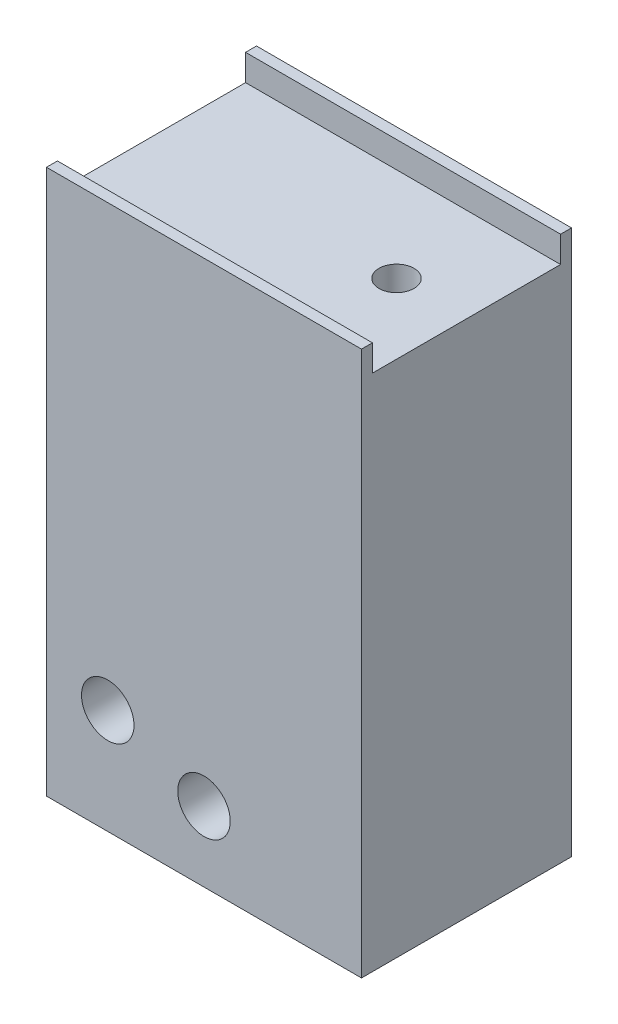
ISO-10303-21;
HEADER;
FILE_DESCRIPTION(('STEP AP214'),'2;1');
FILE_NAME('part.step','',(''),(''),'','','');
FILE_SCHEMA(('AUTOMOTIVE_DESIGN { 1 0 10303 214 1 1 1 1 }'));
ENDSEC;
DATA;
#1=APPLICATION_CONTEXT('core data for automotive mechanical design processes');
#2=APPLICATION_PROTOCOL_DEFINITION('international standard','automotive_design',2000,#1);
#3=PRODUCT_CONTEXT('',#1,'mechanical');
#4=PRODUCT('Part','Part','',(#3));
#5=PRODUCT_RELATED_PRODUCT_CATEGORY('part','',(#4));
#6=PRODUCT_DEFINITION_FORMATION('','',#4);
#7=PRODUCT_DEFINITION_CONTEXT('part definition',#1,'design');
#8=PRODUCT_DEFINITION('design','',#6,#7);
#9=PRODUCT_DEFINITION_SHAPE('','',#8);
#10=(LENGTH_UNIT() NAMED_UNIT(*) SI_UNIT(.MILLI.,.METRE.));
#11=(NAMED_UNIT(*) PLANE_ANGLE_UNIT() SI_UNIT($,.RADIAN.));
#12=(NAMED_UNIT(*) SI_UNIT($,.STERADIAN.) SOLID_ANGLE_UNIT());
#13=UNCERTAINTY_MEASURE_WITH_UNIT(LENGTH_MEASURE(1.E-05),#10,'distance_accuracy_value','');
#14=(GEOMETRIC_REPRESENTATION_CONTEXT(3) GLOBAL_UNCERTAINTY_ASSIGNED_CONTEXT((#13)) GLOBAL_UNIT_ASSIGNED_CONTEXT((#10,
#11,#12)) REPRESENTATION_CONTEXT('',''));
#15=CARTESIAN_POINT('',(0.,0.,0.));
#16=DIRECTION('',(0.,0.,1.));
#17=DIRECTION('',(1.,0.,0.));
#18=AXIS2_PLACEMENT_3D('',#15,#16,#17);
#19=CARTESIAN_POINT('',(8.,0.,-12.));
#20=DIRECTION('',(0.,0.,1.));
#21=DIRECTION('',(1.,0.,0.));
#22=AXIS2_PLACEMENT_3D('',#19,#20,#21);
#23=PLANE('',#22);
#24=CARTESIAN_POINT('',(-6.5,-15.12,-12.));
#25=DIRECTION('',(0.,0.,1.));
#26=DIRECTION('',(1.,0.,0.));
#27=AXIS2_PLACEMENT_3D('',#24,#25,#26);
#28=CIRCLE('',#27,1.5);
#29=CARTESIAN_POINT('',(-5.,-15.12,-12.));
#30=VERTEX_POINT('',#29);
#31=EDGE_CURVE('E124',#30,#30,#28,.T.);
#32=ORIENTED_EDGE('',*,*,#31,.T.);
#33=EDGE_LOOP('',(#32));
#34=FACE_BOUND('',#33,.T.);
#35=CARTESIAN_POINT('',(-0.999999999999999,-17.12,-12.));
#36=DIRECTION('',(0.,0.,1.));
#37=DIRECTION('',(1.,0.,0.));
#38=AXIS2_PLACEMENT_3D('',#35,#36,#37);
#39=CIRCLE('',#38,1.5);
#40=CARTESIAN_POINT('',(0.500000000000003,-17.12,-12.));
#41=VERTEX_POINT('',#40);
#42=EDGE_CURVE('E213',#41,#41,#39,.T.);
#43=ORIENTED_EDGE('',*,*,#42,.T.);
#44=EDGE_LOOP('',(#43));
#45=FACE_BOUND('',#44,.T.);
#46=DIRECTION('',(0.,1.,0.));
#47=VECTOR('',#46,1.);
#48=CARTESIAN_POINT('',(8.,0.,-12.));
#49=LINE('',#48,#47);
#50=CARTESIAN_POINT('',(8.,-21.12,-12.));
#51=VERTEX_POINT('',#50);
#52=CARTESIAN_POINT('',(8.,10.,-12.));
#53=VERTEX_POINT('',#52);
#54=EDGE_CURVE('E151',#51,#53,#49,.T.);
#55=ORIENTED_EDGE('',*,*,#54,.F.);
#56=DIRECTION('',(1.,0.,0.));
#57=VECTOR('',#56,1.);
#58=CARTESIAN_POINT('',(-10.,-21.12,-12.));
#59=LINE('',#58,#57);
#60=CARTESIAN_POINT('',(-10.,-21.12,-12.));
#61=VERTEX_POINT('',#60);
#62=EDGE_CURVE('E120',#61,#51,#59,.T.);
#63=ORIENTED_EDGE('',*,*,#62,.F.);
#64=DIRECTION('',(0.,-1.,0.));
#65=VECTOR('',#64,1.);
#66=CARTESIAN_POINT('',(-10.,10.,-12.));
#67=LINE('',#66,#65);
#68=CARTESIAN_POINT('',(-10.,10.,-12.));
#69=VERTEX_POINT('',#68);
#70=EDGE_CURVE('E130',#69,#61,#67,.T.);
#71=ORIENTED_EDGE('',*,*,#70,.F.);
#72=DIRECTION('',(-1.,0.,0.));
#73=VECTOR('',#72,1.);
#74=CARTESIAN_POINT('',(8.,10.,-12.));
#75=LINE('',#74,#73);
#76=EDGE_CURVE('E11',#53,#69,#75,.T.);
#77=ORIENTED_EDGE('',*,*,#76,.F.);
#78=EDGE_LOOP('',(#55,#63,#71,#77));
#79=FACE_BOUND('',#78,.T.);
#80=ADVANCED_FACE('F37',(#34,#45,#79),#23,.F.);
#81=CARTESIAN_POINT('',(8.,10.,-11.375));
#82=DIRECTION('',(0.,-1.,0.));
#83=DIRECTION('',(0.,0.,-1.));
#84=AXIS2_PLACEMENT_3D('',#81,#82,#83);
#85=PLANE('',#84);
#86=ORIENTED_EDGE('',*,*,#76,.T.);
#87=DIRECTION('',(0.,0.,-1.));
#88=VECTOR('',#87,1.);
#89=CARTESIAN_POINT('',(-10.,10.,-11.375));
#90=LINE('',#89,#88);
#91=CARTESIAN_POINT('',(-10.,10.,-11.375));
#92=VERTEX_POINT('',#91);
#93=EDGE_CURVE('E145',#92,#69,#90,.T.);
#94=ORIENTED_EDGE('',*,*,#93,.F.);
#95=DIRECTION('',(-1.,0.,0.));
#96=VECTOR('',#95,1.);
#97=CARTESIAN_POINT('',(8.,10.,-11.375));
#98=LINE('',#97,#96);
#99=CARTESIAN_POINT('',(8.,10.,-11.375));
#100=VERTEX_POINT('',#99);
#101=EDGE_CURVE('E44',#100,#92,#98,.T.);
#102=ORIENTED_EDGE('',*,*,#101,.F.);
#103=DIRECTION('',(0.,0.,1.));
#104=VECTOR('',#103,1.);
#105=CARTESIAN_POINT('',(8.,10.,-11.375));
#106=LINE('',#105,#104);
#107=EDGE_CURVE('E153',#53,#100,#106,.T.);
#108=ORIENTED_EDGE('',*,*,#107,.F.);
#109=EDGE_LOOP('',(#86,#94,#102,#108));
#110=FACE_BOUND('',#109,.T.);
#111=ADVANCED_FACE('F180',(#110),#85,.F.);
#112=CARTESIAN_POINT('',(8.,10.,-11.375));
#113=DIRECTION('',(0.,0.,-1.));
#114=DIRECTION('',(0.,1.,0.));
#115=AXIS2_PLACEMENT_3D('',#112,#113,#114);
#116=PLANE('',#115);
#117=ORIENTED_EDGE('',*,*,#101,.T.);
#118=DIRECTION('',(0.,1.,0.));
#119=VECTOR('',#118,1.);
#120=CARTESIAN_POINT('',(-10.,8.5,-11.375));
#121=LINE('',#120,#119);
#122=CARTESIAN_POINT('',(-10.,8.5,-11.375));
#123=VERTEX_POINT('',#122);
#124=EDGE_CURVE('E142',#123,#92,#121,.T.);
#125=ORIENTED_EDGE('',*,*,#124,.F.);
#126=DIRECTION('',(-1.,0.,0.));
#127=VECTOR('',#126,1.);
#128=CARTESIAN_POINT('',(8.,8.5,-11.375));
#129=LINE('',#128,#127);
#130=CARTESIAN_POINT('',(8.,8.5,-11.375));
#131=VERTEX_POINT('',#130);
#132=EDGE_CURVE('E166',#131,#123,#129,.T.);
#133=ORIENTED_EDGE('',*,*,#132,.F.);
#134=DIRECTION('',(0.,-1.,0.));
#135=VECTOR('',#134,1.);
#136=CARTESIAN_POINT('',(8.,10.,-11.375));
#137=LINE('',#136,#135);
#138=EDGE_CURVE('E155',#100,#131,#137,.T.);
#139=ORIENTED_EDGE('',*,*,#138,.F.);
#140=EDGE_LOOP('',(#117,#125,#133,#139));
#141=FACE_BOUND('',#140,.T.);
#142=ADVANCED_FACE('F171',(#141),#116,.F.);
#143=CARTESIAN_POINT('',(8.,8.5,-0.624999999999999));
#144=DIRECTION('',(0.,-1.,0.));
#145=DIRECTION('',(0.,0.,-1.));
#146=AXIS2_PLACEMENT_3D('',#143,#144,#145);
#147=PLANE('',#146);
#148=CARTESIAN_POINT('',(4.,8.5,-6.));
#149=DIRECTION('',(0.,-1.,0.));
#150=DIRECTION('',(0.,0.,-1.));
#151=AXIS2_PLACEMENT_3D('',#148,#149,#150);
#152=CIRCLE('',#151,1.);
#153=CARTESIAN_POINT('',(4.,8.5,-7.));
#154=VERTEX_POINT('',#153);
#155=EDGE_CURVE('E148',#154,#154,#152,.F.);
#156=ORIENTED_EDGE('',*,*,#155,.F.);
#157=EDGE_LOOP('',(#156));
#158=FACE_BOUND('',#157,.T.);
#159=ORIENTED_EDGE('',*,*,#132,.T.);
#160=DIRECTION('',(0.,0.,-1.));
#161=VECTOR('',#160,1.);
#162=CARTESIAN_POINT('',(-10.,8.5,-0.624999999999999));
#163=LINE('',#162,#161);
#164=CARTESIAN_POINT('',(-10.,8.5,-0.624999999999999));
#165=VERTEX_POINT('',#164);
#166=EDGE_CURVE('E139',#165,#123,#163,.T.);
#167=ORIENTED_EDGE('',*,*,#166,.F.);
#168=DIRECTION('',(-1.,0.,0.));
#169=VECTOR('',#168,1.);
#170=CARTESIAN_POINT('',(8.,8.5,-0.624999999999999));
#171=LINE('',#170,#169);
#172=CARTESIAN_POINT('',(8.,8.5,-0.624999999999999));
#173=VERTEX_POINT('',#172);
#174=EDGE_CURVE('E164',#173,#165,#171,.T.);
#175=ORIENTED_EDGE('',*,*,#174,.F.);
#176=DIRECTION('',(0.,0.,1.));
#177=VECTOR('',#176,1.);
#178=CARTESIAN_POINT('',(8.,8.5,-0.624999999999999));
#179=LINE('',#178,#177);
#180=EDGE_CURVE('E157',#131,#173,#179,.T.);
#181=ORIENTED_EDGE('',*,*,#180,.F.);
#182=EDGE_LOOP('',(#159,#167,#175,#181));
#183=FACE_BOUND('',#182,.T.);
#184=ADVANCED_FACE('F191',(#158,#183),#147,.F.);
#185=CARTESIAN_POINT('',(8.,10.,-0.625));
#186=DIRECTION('',(0.,0.,1.));
#187=DIRECTION('',(0.,-1.,0.));
#188=AXIS2_PLACEMENT_3D('',#185,#186,#187);
#189=PLANE('',#188);
#190=ORIENTED_EDGE('',*,*,#174,.T.);
#191=DIRECTION('',(0.,-1.,0.));
#192=VECTOR('',#191,1.);
#193=CARTESIAN_POINT('',(-10.,10.,-0.625));
#194=LINE('',#193,#192);
#195=CARTESIAN_POINT('',(-10.,10.,-0.625));
#196=VERTEX_POINT('',#195);
#197=EDGE_CURVE('E136',#196,#165,#194,.T.);
#198=ORIENTED_EDGE('',*,*,#197,.F.);
#199=DIRECTION('',(-1.,0.,0.));
#200=VECTOR('',#199,1.);
#201=CARTESIAN_POINT('',(8.,10.,-0.625));
#202=LINE('',#201,#200);
#203=CARTESIAN_POINT('',(8.,10.,-0.625));
#204=VERTEX_POINT('',#203);
#205=EDGE_CURVE('E162',#204,#196,#202,.T.);
#206=ORIENTED_EDGE('',*,*,#205,.F.);
#207=DIRECTION('',(0.,1.,0.));
#208=VECTOR('',#207,1.);
#209=CARTESIAN_POINT('',(8.,10.,-0.625));
#210=LINE('',#209,#208);
#211=EDGE_CURVE('E56',#173,#204,#210,.T.);
#212=ORIENTED_EDGE('',*,*,#211,.F.);
#213=EDGE_LOOP('',(#190,#198,#206,#212));
#214=FACE_BOUND('',#213,.T.);
#215=ADVANCED_FACE('F188',(#214),#189,.F.);
#216=CARTESIAN_POINT('',(8.,10.,0.));
#217=DIRECTION('',(0.,-1.,0.));
#218=DIRECTION('',(0.,0.,-1.));
#219=AXIS2_PLACEMENT_3D('',#216,#217,#218);
#220=PLANE('',#219);
#221=ORIENTED_EDGE('',*,*,#205,.T.);
#222=DIRECTION('',(0.,0.,-1.));
#223=VECTOR('',#222,1.);
#224=CARTESIAN_POINT('',(-10.,10.,0.));
#225=LINE('',#224,#223);
#226=CARTESIAN_POINT('',(-10.,10.,0.));
#227=VERTEX_POINT('',#226);
#228=EDGE_CURVE('E133',#227,#196,#225,.T.);
#229=ORIENTED_EDGE('',*,*,#228,.F.);
#230=DIRECTION('',(-1.,0.,0.));
#231=VECTOR('',#230,1.);
#232=CARTESIAN_POINT('',(8.,10.,0.));
#233=LINE('',#232,#231);
#234=CARTESIAN_POINT('',(8.,10.,0.));
#235=VERTEX_POINT('',#234);
#236=EDGE_CURVE('E104',#235,#227,#233,.T.);
#237=ORIENTED_EDGE('',*,*,#236,.F.);
#238=DIRECTION('',(0.,0.,1.));
#239=VECTOR('',#238,1.);
#240=CARTESIAN_POINT('',(8.,10.,0.));
#241=LINE('',#240,#239);
#242=EDGE_CURVE('E51',#204,#235,#241,.T.);
#243=ORIENTED_EDGE('',*,*,#242,.F.);
#244=EDGE_LOOP('',(#221,#229,#237,#243));
#245=FACE_BOUND('',#244,.T.);
#246=ADVANCED_FACE('F186',(#245),#220,.F.);
#247=CARTESIAN_POINT('',(8.,0.,0.));
#248=DIRECTION('',(0.,0.,-1.));
#249=DIRECTION('',(-1.,0.,0.));
#250=AXIS2_PLACEMENT_3D('',#247,#248,#249);
#251=PLANE('',#250);
#252=CARTESIAN_POINT('',(-6.5,-15.12,0.));
#253=DIRECTION('',(0.,0.,1.));
#254=DIRECTION('',(1.,0.,0.));
#255=AXIS2_PLACEMENT_3D('',#252,#253,#254);
#256=CIRCLE('',#255,1.5);
#257=CARTESIAN_POINT('',(-5.,-15.12,0.));
#258=VERTEX_POINT('',#257);
#259=EDGE_CURVE('E217',#258,#258,#256,.T.);
#260=ORIENTED_EDGE('',*,*,#259,.F.);
#261=EDGE_LOOP('',(#260));
#262=FACE_BOUND('',#261,.T.);
#263=CARTESIAN_POINT('',(-0.999999999999999,-17.12,0.));
#264=DIRECTION('',(0.,0.,1.));
#265=DIRECTION('',(1.,0.,0.));
#266=AXIS2_PLACEMENT_3D('',#263,#264,#265);
#267=CIRCLE('',#266,1.5);
#268=CARTESIAN_POINT('',(0.500000000000003,-17.12,0.));
#269=VERTEX_POINT('',#268);
#270=EDGE_CURVE('E215',#269,#269,#267,.T.);
#271=ORIENTED_EDGE('',*,*,#270,.F.);
#272=EDGE_LOOP('',(#271));
#273=FACE_BOUND('',#272,.T.);
#274=ORIENTED_EDGE('',*,*,#236,.T.);
#275=DIRECTION('',(0.,1.,0.));
#276=VECTOR('',#275,1.);
#277=CARTESIAN_POINT('',(-10.,0.,0.));
#278=LINE('',#277,#276);
#279=CARTESIAN_POINT('',(-10.,-21.12,0.));
#280=VERTEX_POINT('',#279);
#281=EDGE_CURVE('E110',#280,#227,#278,.T.);
#282=ORIENTED_EDGE('',*,*,#281,.F.);
#283=DIRECTION('',(-1.,0.,0.));
#284=VECTOR('',#283,1.);
#285=CARTESIAN_POINT('',(8.,-21.12,0.));
#286=LINE('',#285,#284);
#287=CARTESIAN_POINT('',(8.,-21.12,0.));
#288=VERTEX_POINT('',#287);
#289=EDGE_CURVE('E107',#288,#280,#286,.T.);
#290=ORIENTED_EDGE('',*,*,#289,.F.);
#291=DIRECTION('',(0.,-1.,0.));
#292=VECTOR('',#291,1.);
#293=CARTESIAN_POINT('',(8.,0.,0.));
#294=LINE('',#293,#292);
#295=EDGE_CURVE('E98',#235,#288,#294,.T.);
#296=ORIENTED_EDGE('',*,*,#295,.F.);
#297=EDGE_LOOP('',(#274,#282,#290,#296));
#298=FACE_BOUND('',#297,.T.);
#299=ADVANCED_FACE('F108',(#262,#273,#298),#251,.F.);
#300=CARTESIAN_POINT('',(8.,0.,0.));
#301=DIRECTION('',(1.,0.,0.));
#302=DIRECTION('',(0.,0.,-1.));
#303=AXIS2_PLACEMENT_3D('',#300,#301,#302);
#304=PLANE('',#303);
#305=ORIENTED_EDGE('',*,*,#295,.T.);
#306=DIRECTION('',(0.,0.,1.));
#307=VECTOR('',#306,1.);
#308=CARTESIAN_POINT('',(8.,-21.12,-12.));
#309=LINE('',#308,#307);
#310=EDGE_CURVE('E102',#51,#288,#309,.T.);
#311=ORIENTED_EDGE('',*,*,#310,.F.);
#312=ORIENTED_EDGE('',*,*,#54,.T.);
#313=ORIENTED_EDGE('',*,*,#107,.T.);
#314=ORIENTED_EDGE('',*,*,#138,.T.);
#315=ORIENTED_EDGE('',*,*,#180,.T.);
#316=ORIENTED_EDGE('',*,*,#211,.T.);
#317=ORIENTED_EDGE('',*,*,#242,.T.);
#318=EDGE_LOOP('',(#305,#311,#312,#313,#314,#315,#316,#317));
#319=FACE_BOUND('',#318,.T.);
#320=ADVANCED_FACE('F100',(#319),#304,.T.);
#321=CARTESIAN_POINT('',(4.,10.001,-6.));
#322=DIRECTION('',(0.,-1.,0.));
#323=DIRECTION('',(0.,0.,-1.));
#324=AXIS2_PLACEMENT_3D('',#321,#322,#323);
#325=CYLINDRICAL_SURFACE('',#324,1.);
#326=ORIENTED_EDGE('',*,*,#155,.T.);
#327=EDGE_LOOP('',(#326));
#328=FACE_BOUND('',#327,.T.);
#329=CARTESIAN_POINT('',(4.,-21.12,-6.));
#330=DIRECTION('',(0.,-1.,0.));
#331=DIRECTION('',(0.,0.,-1.));
#332=AXIS2_PLACEMENT_3D('',#329,#330,#331);
#333=CIRCLE('',#332,1.);
#334=CARTESIAN_POINT('',(4.,-21.12,-7.));
#335=VERTEX_POINT('',#334);
#336=EDGE_CURVE('E121',#335,#335,#333,.T.);
#337=ORIENTED_EDGE('',*,*,#336,.T.);
#338=EDGE_LOOP('',(#337));
#339=FACE_BOUND('',#338,.T.);
#340=ADVANCED_FACE('F244',(#328,#339),#325,.F.);
#341=CARTESIAN_POINT('',(-10.,0.,0.));
#342=DIRECTION('',(-1.,0.,0.));
#343=DIRECTION('',(0.,0.,1.));
#344=AXIS2_PLACEMENT_3D('',#341,#342,#343);
#345=PLANE('',#344);
#346=ORIENTED_EDGE('',*,*,#70,.T.);
#347=DIRECTION('',(0.,0.,-1.));
#348=VECTOR('',#347,1.);
#349=CARTESIAN_POINT('',(-10.,-21.12,0.));
#350=LINE('',#349,#348);
#351=EDGE_CURVE('E114',#280,#61,#350,.T.);
#352=ORIENTED_EDGE('',*,*,#351,.F.);
#353=ORIENTED_EDGE('',*,*,#281,.T.);
#354=ORIENTED_EDGE('',*,*,#228,.T.);
#355=ORIENTED_EDGE('',*,*,#197,.T.);
#356=ORIENTED_EDGE('',*,*,#166,.T.);
#357=ORIENTED_EDGE('',*,*,#124,.T.);
#358=ORIENTED_EDGE('',*,*,#93,.T.);
#359=EDGE_LOOP('',(#346,#352,#353,#354,#355,#356,#357,#358));
#360=FACE_BOUND('',#359,.T.);
#361=ADVANCED_FACE('F177',(#360),#345,.T.);
#362=CARTESIAN_POINT('',(0.,-21.12,0.));
#363=DIRECTION('',(0.,-1.,0.));
#364=DIRECTION('',(0.,0.,-1.));
#365=AXIS2_PLACEMENT_3D('',#362,#363,#364);
#366=PLANE('',#365);
#367=ORIENTED_EDGE('',*,*,#310,.T.);
#368=ORIENTED_EDGE('',*,*,#289,.T.);
#369=ORIENTED_EDGE('',*,*,#351,.T.);
#370=ORIENTED_EDGE('',*,*,#62,.T.);
#371=EDGE_LOOP('',(#367,#368,#369,#370));
#372=FACE_BOUND('',#371,.T.);
#373=ORIENTED_EDGE('',*,*,#336,.F.);
#374=EDGE_LOOP('',(#373));
#375=FACE_BOUND('',#374,.T.);
#376=ADVANCED_FACE('F117',(#372,#375),#366,.T.);
#377=CARTESIAN_POINT('',(-0.999999999999999,-17.12,-12.));
#378=DIRECTION('',(0.,0.,1.));
#379=DIRECTION('',(1.,0.,0.));
#380=AXIS2_PLACEMENT_3D('',#377,#378,#379);
#381=CYLINDRICAL_SURFACE('',#380,1.5);
#382=ORIENTED_EDGE('',*,*,#42,.F.);
#383=EDGE_LOOP('',(#382));
#384=FACE_BOUND('',#383,.T.);
#385=ORIENTED_EDGE('',*,*,#270,.T.);
#386=EDGE_LOOP('',(#385));
#387=FACE_BOUND('',#386,.T.);
#388=ADVANCED_FACE('F231',(#384,#387),#381,.F.);
#389=CARTESIAN_POINT('',(-6.5,-15.12,-12.));
#390=DIRECTION('',(0.,0.,1.));
#391=DIRECTION('',(1.,0.,0.));
#392=AXIS2_PLACEMENT_3D('',#389,#390,#391);
#393=CYLINDRICAL_SURFACE('',#392,1.5);
#394=ORIENTED_EDGE('',*,*,#31,.F.);
#395=EDGE_LOOP('',(#394));
#396=FACE_BOUND('',#395,.T.);
#397=ORIENTED_EDGE('',*,*,#259,.T.);
#398=EDGE_LOOP('',(#397));
#399=FACE_BOUND('',#398,.T.);
#400=ADVANCED_FACE('F224',(#396,#399),#393,.F.);
#401=CLOSED_SHELL('',(#80,#111,#142,#184,#215,#246,#299,#320,#340,#361,#376,#388,#400));
#402=MANIFOLD_SOLID_BREP('B2',#401);
#403=ADVANCED_BREP_SHAPE_REPRESENTATION('',(#18,#402),#14);
#404=SHAPE_DEFINITION_REPRESENTATION(#9,#403);
ENDSEC;
END-ISO-10303-21;
